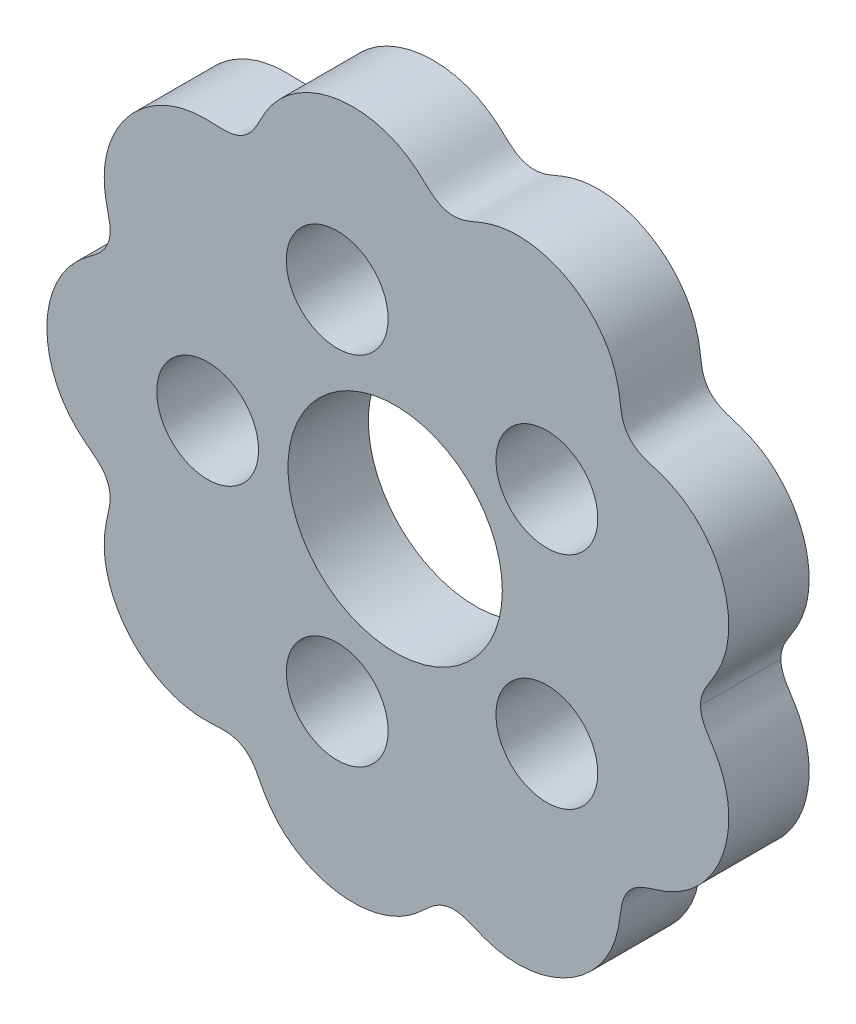
ISO-10303-21;
HEADER;
FILE_DESCRIPTION(('STEP AP214'),'2;1');
FILE_NAME('part.step','',(''),(''),'','','');
FILE_SCHEMA(('AUTOMOTIVE_DESIGN { 1 0 10303 214 1 1 1 1 }'));
ENDSEC;
DATA;
#1=APPLICATION_CONTEXT('core data for automotive mechanical design processes');
#2=APPLICATION_PROTOCOL_DEFINITION('international standard','automotive_design',2000,#1);
#3=PRODUCT_CONTEXT('',#1,'mechanical');
#4=PRODUCT('Part','Part','',(#3));
#5=PRODUCT_RELATED_PRODUCT_CATEGORY('part','',(#4));
#6=PRODUCT_DEFINITION_FORMATION('','',#4);
#7=PRODUCT_DEFINITION_CONTEXT('part definition',#1,'design');
#8=PRODUCT_DEFINITION('design','',#6,#7);
#9=PRODUCT_DEFINITION_SHAPE('','',#8);
#10=(LENGTH_UNIT() NAMED_UNIT(*) SI_UNIT(.MILLI.,.METRE.));
#11=(NAMED_UNIT(*) PLANE_ANGLE_UNIT() SI_UNIT($,.RADIAN.));
#12=(NAMED_UNIT(*) SI_UNIT($,.STERADIAN.) SOLID_ANGLE_UNIT());
#13=UNCERTAINTY_MEASURE_WITH_UNIT(LENGTH_MEASURE(1.E-05),#10,'distance_accuracy_value','');
#14=(GEOMETRIC_REPRESENTATION_CONTEXT(3) GLOBAL_UNCERTAINTY_ASSIGNED_CONTEXT((#13)) GLOBAL_UNIT_ASSIGNED_CONTEXT((#10,
#11,#12)) REPRESENTATION_CONTEXT('',''));
#15=CARTESIAN_POINT('',(0.,0.,0.));
#16=DIRECTION('',(0.,0.,1.));
#17=DIRECTION('',(1.,0.,0.));
#18=AXIS2_PLACEMENT_3D('',#15,#16,#17);
#19=CARTESIAN_POINT('',(11.3999989917467,1.81851572087898E-05,3.));
#20=CARTESIAN_POINT('',(11.3999990024026,0.000705439475057053,3.));
#21=CARTESIAN_POINT('',(11.4000420933702,0.0547863397009753,3.));
#22=CARTESIAN_POINT('',(11.4067352179657,0.162251476006239,3.));
#23=CARTESIAN_POINT('',(11.4363812233727,0.321248146223175,3.));
#24=CARTESIAN_POINT('',(11.5103206113927,0.522519574219464,3.));
#25=CARTESIAN_POINT('',(11.6102501358687,0.711732960326352,3.));
#26=CARTESIAN_POINT('',(11.7241130411315,0.892488779271416,3.));
#27=CARTESIAN_POINT('',(11.8693728476593,1.11645787558788,3.));
#28=CARTESIAN_POINT('',(12.0749889406882,1.46093017895599,3.));
#29=CARTESIAN_POINT('',(12.2930855405998,1.95204284639744,3.));
#30=CARTESIAN_POINT('',(12.4500317358036,2.60721321775751,3.));
#31=CARTESIAN_POINT('',(12.4748418562447,3.36093141714105,3.));
#32=CARTESIAN_POINT('',(12.3537522721841,4.10505088504915,3.));
#33=CARTESIAN_POINT('',(12.094334932653,4.81258084310001,3.));
#34=CARTESIAN_POINT('',(11.7059973573458,5.45860530180516,3.));
#35=CARTESIAN_POINT('',(11.1999239153354,6.01734901698739,3.));
#36=CARTESIAN_POINT('',(10.6570709906344,6.4157760932387,3.));
#37=CARTESIAN_POINT('',(10.1247002737361,6.67234800872518,3.));
#38=CARTESIAN_POINT('',(9.6417613060848,6.82893891993528,3.));
#39=CARTESIAN_POINT('',(9.2306062573709,6.94638484004782,3.));
#40=CARTESIAN_POINT('',(8.85286532051666,7.16043974210885,3.));
#41=CARTESIAN_POINT('',(8.57493041459187,7.49992463111007,3.));
#42=CARTESIAN_POINT('',(8.43897096337619,7.91194938965621,3.));
#43=CARTESIAN_POINT('',(8.39687968259317,8.33739873011806,3.));
#44=CARTESIAN_POINT('',(8.32300774126344,8.84028589815767,3.));
#45=CARTESIAN_POINT('',(8.15819324710137,9.40808556277449,3.));
#46=CARTESIAN_POINT('',(7.85493317619153,10.0098768493242,3.));
#47=CARTESIAN_POINT('',(7.38769966084967,10.6020235261066,3.));
#48=CARTESIAN_POINT('',(6.81358797818073,11.0935577658307,3.));
#49=CARTESIAN_POINT('',(6.15570462214443,11.4683226056225,3.));
#50=CARTESIAN_POINT('',(5.43672729516141,11.7116236986651,3.));
#51=CARTESIAN_POINT('',(4.77669842067262,11.7981492679716,3.));
#52=CARTESIAN_POINT('',(4.20773285261801,11.7749064101158,3.));
#53=CARTESIAN_POINT('',(3.73207554026398,11.6875130737394,3.));
#54=CARTESIAN_POINT('',(3.34884669272879,11.5727502965553,3.));
#55=CARTESIAN_POINT('',(2.97057002041107,11.4167919638044,3.));
#56=CARTESIAN_POINT('',(2.58506990398777,11.2479076487187,3.));
#57=CARTESIAN_POINT('',(2.16231493100206,11.1767501241042,3.));
#58=CARTESIAN_POINT('',(1.7361923809846,11.2621779174198,3.));
#59=CARTESIAN_POINT('',(1.37094004701185,11.4923489425404,3.));
#60=CARTESIAN_POINT('',(1.06602591445675,11.7912776366317,3.));
#61=CARTESIAN_POINT('',(0.688202454705581,12.1255865646436,3.));
#62=CARTESIAN_POINT('',(0.202850897512074,12.4496698770165,3.));
#63=CARTESIAN_POINT('',(-0.405523163007366,12.712162963489,3.));
#64=CARTESIAN_POINT('',(-1.12874115490884,12.8662185745688,3.));
#65=CARTESIAN_POINT('',(-2.06008778584659,12.8835964321083,3.));
#66=CARTESIAN_POINT('',(-2.97744493519412,12.6677352102254,3.));
#67=CARTESIAN_POINT('',(-3.81535367010169,12.2256055357117,3.));
#68=CARTESIAN_POINT('',(-4.44454049376201,11.6352304390279,3.));
#69=CARTESIAN_POINT('',(-4.79447486093211,11.1586623302305,3.));
#70=CARTESIAN_POINT('',(-5.0365286083116,10.7115176297563,3.));
#71=CARTESIAN_POINT('',(-5.22126998193903,10.326051933504,3.));
#72=CARTESIAN_POINT('',(-5.4873307792823,9.98555100308818,3.));
#73=CARTESIAN_POINT('',(-5.85982090683654,9.76113040464926,3.));
#74=CARTESIAN_POINT('',(-6.28185604719141,9.68537316295917,3.));
#75=CARTESIAN_POINT('',(-6.70171329511556,9.71265644556543,3.));
#76=CARTESIAN_POINT('',(-7.2052282592365,9.73347343135155,3.));
#77=CARTESIAN_POINT('',(-7.79367421932067,9.67927270455973,3.));
#78=CARTESIAN_POINT('',(-8.44483884445679,9.49441831131706,3.));
#79=CARTESIAN_POINT('',(-9.11955889728369,9.14265660631011,3.));
#80=CARTESIAN_POINT('',(-9.71117372586009,8.66704162205741,3.));
#81=CARTESIAN_POINT('',(-10.2003866631958,8.08920176324512,3.));
#82=CARTESIAN_POINT('',(-10.5706833952524,7.43037679956918,3.));
#83=CARTESIAN_POINT('',(-10.8061030666256,6.71388626148928,3.));
#84=CARTESIAN_POINT('',(-10.8841237114647,6.04461406055604,3.));
#85=CARTESIAN_POINT('',(-10.8438836577711,5.45482196469358,3.));
#86=CARTESIAN_POINT('',(-10.7406173019672,4.95723777198673,3.));
#87=CARTESIAN_POINT('',(-10.6350619348902,4.54296347080145,3.));
#88=CARTESIAN_POINT('',(-10.6237680921343,4.1091443268693,3.));
#89=CARTESIAN_POINT('',(-10.7709039530337,3.69581958921924,3.));
#90=CARTESIAN_POINT('',(-11.0539749845063,3.36672206141808,3.));
#91=CARTESIAN_POINT('',(-11.400668961427,3.11627514796072,3.));
#92=CARTESIAN_POINT('',(-11.7264206650194,2.86084047401432,3.));
#93=CARTESIAN_POINT('',(-12.0158354871817,2.58200229846591,3.));
#94=CARTESIAN_POINT('',(-12.2638944005597,2.28328683249548,3.));
#95=CARTESIAN_POINT('',(-12.4724801287949,1.97129926487625,3.));
#96=CARTESIAN_POINT('',(-12.6477521246535,1.63957867836261,3.));
#97=CARTESIAN_POINT('',(-12.7890789662336,1.29202143193634,3.));
#98=CARTESIAN_POINT('',(-12.8956000229937,0.932326970092357,3.));
#99=CARTESIAN_POINT('',(-12.9669245221612,0.56400149367318,3.));
#100=CARTESIAN_POINT('',(-12.9939386678957,0.283223765885403,3.));
#101=CARTESIAN_POINT('',(-12.99998179874,0.0951724036943985,3.));
#102=CARTESIAN_POINT('',(-13.0000002913471,0.00076278550905635,3.));
#103=CARTESIAN_POINT('',(-13.0000002439252,0.,3.));
#104=B_SPLINE_CURVE_WITH_KNOTS('',4,(#19,#20,#21,#22,#23,#24,#25,#26,#27,#28,#29,#30,#31,#32,
#33,#34,#35,#36,#37,#38,#39,#40,#41,#42,#43,#44,#45,#46,#47,#48,#49,#50,#51,#52,#53,#54,#55,#56,
#57,#58,#59,#60,#61,#62,#63,#64,#65,#66,#67,#68,#69,#70,#71,#72,#73,#74,#75,#76,#77,#78,#79,#80,
#81,#82,#83,#84,#85,#86,#87,#88,#89,#90,#91,#92,#93,#94,#95,#96,#97,#98,#99,#100,#101,#102,
#103),.UNSPECIFIED.,.F.,.F.,(5,1,1,1,1,1,1,1,1,1,1,1,1,1,1,1,1,1,1,1,1,1,1,1,1,1,1,1,1,1,1,1,1,
1,1,1,1,1,1,1,1,1,1,1,1,1,1,1,1,1,1,1,1,1,1,1,1,1,1,1,1,1,1,1,1,1,1,1,1,1,1,1,1,1,1,1,1,1,1,1,1,
5),(0.119653364188806,0.119702875056604,0.123549436924655,0.127395998792706,0.131242560660757,
0.135089122528808,0.138935684396859,0.142782246264911,0.150475370001013,0.163970387193504,
0.177465404385995,0.190960421578486,0.204455438770977,0.217945208915162,0.231434979059346,
0.24492474920353,0.258414519347714,0.266104685879341,0.273794852410968,0.281485018942595,
0.289175185474222,0.296870304377093,0.304565423279965,0.312260542182836,0.319955661085707,
0.333454153490124,0.346952645894541,0.360451138298958,0.373949630703374,0.387561798374503,
0.401173966045632,0.41478613371676,0.421592217552325,0.428398301387889,0.435960585437096,
0.443522869486303,0.451085153535511,0.458647437584718,0.466336371347433,0.474025305110148,
0.481714238872864,0.489403172635579,0.502638697892602,0.515874223149625,0.529109748406649,
0.542345273663672,0.569345726421422,0.582845952800297,0.596346179179172,0.604042304245698,
0.611738429312224,0.619434554378751,0.627130679445277,0.634693899127809,0.642257118810342,
0.649820338492875,0.657383558175408,0.670997536382291,0.684611514589174,0.698225492796057,
0.711839471002939,0.725336227369788,0.738832983736637,0.752329740103485,0.765826496470334,
0.773520615092133,0.781214733713933,0.788908852335733,0.796602970957532,0.804294119141854,
0.811985267326176,0.819676415510498,0.82736756369482,0.834113326269207,0.840859088843594,
0.847604851417981,0.854350613992368,0.861096376566755,0.867842139141142,0.874587901715529,
0.881333664289916,0.881388610828979),.UNSPECIFIED.);
#105=DIRECTION('',(0.,0.,-1.));
#106=VECTOR('',#105,1.);
#107=SURFACE_OF_LINEAR_EXTRUSION('',#104,#106);
#108=CARTESIAN_POINT('',(11.3999989917467,1.81851572087898E-05,0.));
#109=CARTESIAN_POINT('',(11.3999990024026,0.000705439475057053,0.));
#110=CARTESIAN_POINT('',(11.4000420933702,0.0547863397009753,0.));
#111=CARTESIAN_POINT('',(11.4067352179657,0.162251476006239,0.));
#112=CARTESIAN_POINT('',(11.4363812233727,0.321248146223175,0.));
#113=CARTESIAN_POINT('',(11.5103206113927,0.522519574219464,0.));
#114=CARTESIAN_POINT('',(11.6102501358687,0.711732960326352,0.));
#115=CARTESIAN_POINT('',(11.7241130411315,0.892488779271416,0.));
#116=CARTESIAN_POINT('',(11.8693728476593,1.11645787558788,0.));
#117=CARTESIAN_POINT('',(12.0749889406882,1.46093017895599,0.));
#118=CARTESIAN_POINT('',(12.2930855405998,1.95204284639744,0.));
#119=CARTESIAN_POINT('',(12.4500317358036,2.60721321775751,0.));
#120=CARTESIAN_POINT('',(12.4748418562447,3.36093141714105,0.));
#121=CARTESIAN_POINT('',(12.3537522721841,4.10505088504915,0.));
#122=CARTESIAN_POINT('',(12.094334932653,4.81258084310001,0.));
#123=CARTESIAN_POINT('',(11.7059973573458,5.45860530180516,0.));
#124=CARTESIAN_POINT('',(11.1999239153354,6.01734901698739,0.));
#125=CARTESIAN_POINT('',(10.6570709906344,6.4157760932387,0.));
#126=CARTESIAN_POINT('',(10.1247002737361,6.67234800872518,0.));
#127=CARTESIAN_POINT('',(9.6417613060848,6.82893891993528,0.));
#128=CARTESIAN_POINT('',(9.2306062573709,6.94638484004782,0.));
#129=CARTESIAN_POINT('',(8.85286532051666,7.16043974210885,0.));
#130=CARTESIAN_POINT('',(8.57493041459187,7.49992463111007,0.));
#131=CARTESIAN_POINT('',(8.43897096337619,7.91194938965621,0.));
#132=CARTESIAN_POINT('',(8.39687968259317,8.33739873011806,0.));
#133=CARTESIAN_POINT('',(8.32300774126344,8.84028589815767,0.));
#134=CARTESIAN_POINT('',(8.15819324710137,9.40808556277449,0.));
#135=CARTESIAN_POINT('',(7.85493317619153,10.0098768493242,0.));
#136=CARTESIAN_POINT('',(7.38769966084967,10.6020235261066,0.));
#137=CARTESIAN_POINT('',(6.81358797818073,11.0935577658307,0.));
#138=CARTESIAN_POINT('',(6.15570462214443,11.4683226056225,0.));
#139=CARTESIAN_POINT('',(5.43672729516141,11.7116236986651,0.));
#140=CARTESIAN_POINT('',(4.77669842067262,11.7981492679716,0.));
#141=CARTESIAN_POINT('',(4.20773285261801,11.7749064101158,0.));
#142=CARTESIAN_POINT('',(3.73207554026398,11.6875130737394,0.));
#143=CARTESIAN_POINT('',(3.34884669272879,11.5727502965553,0.));
#144=CARTESIAN_POINT('',(2.97057002041107,11.4167919638044,0.));
#145=CARTESIAN_POINT('',(2.58506990398777,11.2479076487187,0.));
#146=CARTESIAN_POINT('',(2.16231493100206,11.1767501241042,0.));
#147=CARTESIAN_POINT('',(1.7361923809846,11.2621779174198,0.));
#148=CARTESIAN_POINT('',(1.37094004701185,11.4923489425404,0.));
#149=CARTESIAN_POINT('',(1.06602591445675,11.7912776366317,0.));
#150=CARTESIAN_POINT('',(0.688202454705581,12.1255865646436,0.));
#151=CARTESIAN_POINT('',(0.202850897512074,12.4496698770165,0.));
#152=CARTESIAN_POINT('',(-0.405523163007366,12.712162963489,0.));
#153=CARTESIAN_POINT('',(-1.12874115490884,12.8662185745688,0.));
#154=CARTESIAN_POINT('',(-2.06008778584659,12.8835964321083,0.));
#155=CARTESIAN_POINT('',(-2.97744493519412,12.6677352102254,0.));
#156=CARTESIAN_POINT('',(-3.81535367010169,12.2256055357117,0.));
#157=CARTESIAN_POINT('',(-4.44454049376201,11.6352304390279,0.));
#158=CARTESIAN_POINT('',(-4.79447486093211,11.1586623302305,0.));
#159=CARTESIAN_POINT('',(-5.0365286083116,10.7115176297563,0.));
#160=CARTESIAN_POINT('',(-5.22126998193903,10.326051933504,0.));
#161=CARTESIAN_POINT('',(-5.4873307792823,9.98555100308818,0.));
#162=CARTESIAN_POINT('',(-5.85982090683654,9.76113040464926,0.));
#163=CARTESIAN_POINT('',(-6.28185604719141,9.68537316295917,0.));
#164=CARTESIAN_POINT('',(-6.70171329511556,9.71265644556543,0.));
#165=CARTESIAN_POINT('',(-7.2052282592365,9.73347343135155,0.));
#166=CARTESIAN_POINT('',(-7.79367421932067,9.67927270455973,0.));
#167=CARTESIAN_POINT('',(-8.44483884445679,9.49441831131706,0.));
#168=CARTESIAN_POINT('',(-9.11955889728369,9.14265660631011,0.));
#169=CARTESIAN_POINT('',(-9.71117372586009,8.66704162205741,0.));
#170=CARTESIAN_POINT('',(-10.2003866631958,8.08920176324512,0.));
#171=CARTESIAN_POINT('',(-10.5706833952524,7.43037679956918,0.));
#172=CARTESIAN_POINT('',(-10.8061030666256,6.71388626148928,0.));
#173=CARTESIAN_POINT('',(-10.8841237114647,6.04461406055604,0.));
#174=CARTESIAN_POINT('',(-10.8438836577711,5.45482196469358,0.));
#175=CARTESIAN_POINT('',(-10.7406173019672,4.95723777198673,0.));
#176=CARTESIAN_POINT('',(-10.6350619348902,4.54296347080145,0.));
#177=CARTESIAN_POINT('',(-10.6237680921343,4.1091443268693,0.));
#178=CARTESIAN_POINT('',(-10.7709039530337,3.69581958921924,0.));
#179=CARTESIAN_POINT('',(-11.0539749845063,3.36672206141808,0.));
#180=CARTESIAN_POINT('',(-11.400668961427,3.11627514796072,0.));
#181=CARTESIAN_POINT('',(-11.7264206650194,2.86084047401432,0.));
#182=CARTESIAN_POINT('',(-12.0158354871817,2.58200229846591,0.));
#183=CARTESIAN_POINT('',(-12.2638944005597,2.28328683249548,0.));
#184=CARTESIAN_POINT('',(-12.4724801287949,1.97129926487625,0.));
#185=CARTESIAN_POINT('',(-12.6477521246535,1.63957867836261,0.));
#186=CARTESIAN_POINT('',(-12.7890789662336,1.29202143193634,0.));
#187=CARTESIAN_POINT('',(-12.8956000229937,0.932326970092357,0.));
#188=CARTESIAN_POINT('',(-12.9669245221612,0.56400149367318,0.));
#189=CARTESIAN_POINT('',(-12.9939386678957,0.283223765885403,0.));
#190=CARTESIAN_POINT('',(-12.99998179874,0.0951724036943985,0.));
#191=CARTESIAN_POINT('',(-13.0000002913471,0.00076278550905635,0.));
#192=CARTESIAN_POINT('',(-13.0000002439252,0.,0.));
#193=B_SPLINE_CURVE_WITH_KNOTS('',4,(#108,#109,#110,#111,#112,#113,#114,#115,#116,#117,#118,
#119,#120,#121,#122,#123,#124,#125,#126,#127,#128,#129,#130,#131,#132,#133,#134,#135,#136,#137,
#138,#139,#140,#141,#142,#143,#144,#145,#146,#147,#148,#149,#150,#151,#152,#153,#154,#155,#156,
#157,#158,#159,#160,#161,#162,#163,#164,#165,#166,#167,#168,#169,#170,#171,#172,#173,#174,#175,
#176,#177,#178,#179,#180,#181,#182,#183,#184,#185,#186,#187,#188,#189,#190,#191,#192),
.UNSPECIFIED.,.F.,.F.,(5,1,1,1,1,1,1,1,1,1,1,1,1,1,1,1,1,1,1,1,1,1,1,1,1,1,1,1,1,1,1,1,1,1,1,1,
1,1,1,1,1,1,1,1,1,1,1,1,1,1,1,1,1,1,1,1,1,1,1,1,1,1,1,1,1,1,1,1,1,1,1,1,1,1,1,1,1,1,1,1,1,5),
(0.119653364188806,0.119702875056604,0.123549436924655,0.127395998792706,0.131242560660757,
0.135089122528808,0.138935684396859,0.142782246264911,0.150475370001013,0.163970387193504,
0.177465404385995,0.190960421578486,0.204455438770977,0.217945208915162,0.231434979059346,
0.24492474920353,0.258414519347714,0.266104685879341,0.273794852410968,0.281485018942595,
0.289175185474222,0.296870304377093,0.304565423279965,0.312260542182836,0.319955661085707,
0.333454153490124,0.346952645894541,0.360451138298958,0.373949630703374,0.387561798374503,
0.401173966045632,0.41478613371676,0.421592217552325,0.428398301387889,0.435960585437096,
0.443522869486303,0.451085153535511,0.458647437584718,0.466336371347433,0.474025305110148,
0.481714238872864,0.489403172635579,0.502638697892602,0.515874223149625,0.529109748406649,
0.542345273663672,0.569345726421422,0.582845952800297,0.596346179179172,0.604042304245698,
0.611738429312224,0.619434554378751,0.627130679445277,0.634693899127809,0.642257118810342,
0.649820338492875,0.657383558175408,0.670997536382291,0.684611514589174,0.698225492796057,
0.711839471002939,0.725336227369788,0.738832983736637,0.752329740103485,0.765826496470334,
0.773520615092133,0.781214733713933,0.788908852335733,0.796602970957532,0.804294119141854,
0.811985267326176,0.819676415510498,0.82736756369482,0.834113326269207,0.840859088843594,
0.847604851417981,0.854350613992368,0.861096376566755,0.867842139141142,0.874587901715529,
0.881333664289916,0.881388610828979),.UNSPECIFIED.);
#194=CARTESIAN_POINT('',(11.3999989915989,1.81851647786463E-05,0.));
#195=VERTEX_POINT('',#194);
#196=CARTESIAN_POINT('',(-13.0000002439252,-1.48388152961432E-11,0.));
#197=VERTEX_POINT('',#196);
#198=EDGE_CURVE('E73',#195,#197,#193,.T.);
#199=ORIENTED_EDGE('',*,*,#198,.T.);
#200=DIRECTION('',(0.,0.,-1.));
#201=VECTOR('',#200,1.);
#202=CARTESIAN_POINT('',(-13.0000002439252,-1.48388152961432E-11,3.));
#203=LINE('',#202,#201);
#204=CARTESIAN_POINT('',(-13.0000002439252,-1.48388152961432E-11,3.));
#205=VERTEX_POINT('',#204);
#206=EDGE_CURVE('E11',#205,#197,#203,.T.);
#207=ORIENTED_EDGE('',*,*,#206,.F.);
#208=CARTESIAN_POINT('',(11.3999989915989,1.81851647786463E-05,3.));
#209=VERTEX_POINT('',#208);
#210=EDGE_CURVE('E72',#209,#205,#104,.T.);
#211=ORIENTED_EDGE('',*,*,#210,.F.);
#212=DIRECTION('',(0.,0.,-1.));
#213=VECTOR('',#212,1.);
#214=CARTESIAN_POINT('',(11.3999989915989,1.81851647786463E-05,3.));
#215=LINE('',#214,#213);
#216=EDGE_CURVE('E49',#209,#195,#215,.T.);
#217=ORIENTED_EDGE('',*,*,#216,.T.);
#218=EDGE_LOOP('',(#199,#207,#211,#217));
#219=FACE_BOUND('',#218,.T.);
#220=ADVANCED_FACE('F39',(#219),#107,.F.);
#221=CARTESIAN_POINT('',(-13.0000002439252,-1.48388152961432E-11,3.));
#222=CARTESIAN_POINT('',(-13.0000002907787,-0.000762785523931889,3.));
#223=CARTESIAN_POINT('',(-12.9999817278085,-0.0951724036954654,3.));
#224=CARTESIAN_POINT('',(-12.9939384568106,-0.283223761382507,3.));
#225=CARTESIAN_POINT('',(-12.9669241018142,-0.564001469036718,3.));
#226=CARTESIAN_POINT('',(-12.8955993281358,-0.932326892298051,3.));
#227=CARTESIAN_POINT('',(-12.7890780032974,-1.2920212747524,3.));
#228=CARTESIAN_POINT('',(-12.647750902685,-1.63957841584849,3.));
#229=CARTESIAN_POINT('',(-12.472478659597,-1.97129887173282,3.));
#230=CARTESIAN_POINT('',(-12.2638926988393,-2.28328628389421,3.));
#231=CARTESIAN_POINT('',(-12.0158335628304,-2.58200156498768,3.));
#232=CARTESIAN_POINT('',(-11.7264185328517,-2.8608395248368,3.));
#233=CARTESIAN_POINT('',(-11.4006666388855,-3.11627395600224,3.));
#234=CARTESIAN_POINT('',(-11.0539724753082,-3.36672061107049,3.));
#235=CARTESIAN_POINT('',(-10.7709011985611,-3.69581792790034,3.));
#236=CARTESIAN_POINT('',(-10.6237650296132,-4.10914255589077,3.));
#237=CARTESIAN_POINT('',(-10.6350585490462,-4.54296170824003,3.));
#238=CARTESIAN_POINT('',(-10.7406136073669,-4.95723608809502,3.));
#239=CARTESIAN_POINT('',(-10.8438795923241,-5.45482035776555,3.));
#240=CARTESIAN_POINT('',(-10.8841192064491,-6.04461248361853,3.));
#241=CARTESIAN_POINT('',(-10.8060980628052,-6.71388462640325,3.));
#242=CARTESIAN_POINT('',(-10.5706778574357,-7.43037498902601,3.));
#243=CARTESIAN_POINT('',(-10.2003806343608,-8.08919967672173,3.));
#244=CARTESIAN_POINT('',(-9.71116726636451,-8.66703917092626,3.));
#245=CARTESIAN_POINT('',(-9.11955208331513,-9.14265371425168,3.));
#246=CARTESIAN_POINT('',(-8.44483176832244,-9.49441491639354,3.));
#247=CARTESIAN_POINT('',(-7.79366700541558,-9.67926882432689,3.));
#248=CARTESIAN_POINT('',(-7.20522100493608,-9.73346911255329,3.));
#249=CARTESIAN_POINT('',(-6.70170605633007,-9.71265175150036,3.));
#250=CARTESIAN_POINT('',(-6.2818488287401,-9.6853681559769,3.));
#251=CARTESIAN_POINT('',(-5.85981363192391,-9.76112508312659,3.));
#252=CARTESIAN_POINT('',(-5.48732333711038,-9.98554540395069,3.));
#253=CARTESIAN_POINT('',(-5.22126228599379,-10.3260461360729,3.));
#254=CARTESIAN_POINT('',(-5.03652062508104,-10.7115116946383,3.));
#255=CARTESIAN_POINT('',(-4.79446654444723,-11.1586562147111,3.));
#256=CARTESIAN_POINT('',(-4.44453182209374,-11.6352240627043,3.));
#257=CARTESIAN_POINT('',(-3.81534455843041,-12.2255986904586,3.));
#258=CARTESIAN_POINT('',(-2.97743549400635,-12.6677277404836,3.));
#259=CARTESIAN_POINT('',(-2.06007818377895,-12.8835882786655,3.));
#260=CARTESIAN_POINT('',(-1.12873156579308,-12.8662097269986,3.));
#261=CARTESIAN_POINT('',(-0.405513688708568,-12.7121535769086,3.));
#262=CARTESIAN_POINT('',(0.202860176176108,-12.4496600370184,3.));
#263=CARTESIAN_POINT('',(0.68821149183204,-12.1255763629159,3.));
#264=CARTESIAN_POINT('',(1.06603470242457,-11.7912671533145,3.));
#265=CARTESIAN_POINT('',(1.37094861218974,-11.4923382319725,3.));
#266=CARTESIAN_POINT('',(1.73620077461725,-11.2621669346315,3.));
#267=CARTESIAN_POINT('',(2.16232326096574,-11.1767388237292,3.));
#268=CARTESIAN_POINT('',(2.58507828698463,-11.2478960332668,3.));
#269=CARTESIAN_POINT('',(2.97057852927633,-11.4167800610414,3.));
#270=CARTESIAN_POINT('',(3.3488553178288,-11.5727381118648,3.));
#271=CARTESIAN_POINT('',(3.73208425089594,-11.6875006034307,3.));
#272=CARTESIAN_POINT('',(4.20774162838359,-11.7748935853023,3.));
#273=CARTESIAN_POINT('',(4.77670721376081,-11.7981360191114,3.));
#274=CARTESIAN_POINT('',(5.4367360237624,-11.7116099578892,3.));
#275=CARTESIAN_POINT('',(6.15571316941431,-11.4683083289969,3.));
#276=CARTESIAN_POINT('',(6.81359624614034,-11.0935429988885,3.));
#277=CARTESIAN_POINT('',(7.38770756247145,-10.6020083312824,3.));
#278=CARTESIAN_POINT('',(7.85494063648966,-10.0098613062737,3.));
#279=CARTESIAN_POINT('',(8.15820025888781,-9.4080697937062,3.));
#280=CARTESIAN_POINT('',(8.323014329872,-8.84027000625423,3.));
#281=CARTESIAN_POINT('',(8.39688589640278,-8.33738278315843,3.));
#282=CARTESIAN_POINT('',(8.43897686010083,-7.91193341132631,3.));
#283=CARTESIAN_POINT('',(8.57493600423678,-7.49990855145048,3.));
#284=CARTESIAN_POINT('',(8.85287065714535,-7.16042345530606,3.));
#285=CARTESIAN_POINT('',(9.23061143446559,-6.94636827171693,3.));
#286=CARTESIAN_POINT('',(9.6417663956476,-6.82892204517292,3.));
#287=CARTESIAN_POINT('',(10.1247052465924,-6.67233077403122,3.));
#288=CARTESIAN_POINT('',(10.657075772269,-6.41575846177195,3.));
#289=CARTESIAN_POINT('',(11.1999284000245,-6.01733098093558,3.));
#290=CARTESIAN_POINT('',(11.7060014256063,-5.45858688857986,3.));
#291=CARTESIAN_POINT('',(12.094338519435,-4.81256214044912,3.));
#292=CARTESIAN_POINT('',(12.353755331648,-4.1050319890562,3.));
#293=CARTESIAN_POINT('',(12.4748443611206,-3.36091243090093,3.));
#294=CARTESIAN_POINT('',(12.4500336789376,-2.60719425000845,3.));
#295=CARTESIAN_POINT('',(12.2930869954392,-1.95202399561965,3.));
#296=CARTESIAN_POINT('',(12.0749900295041,-1.46091149072449,3.));
#297=CARTESIAN_POINT('',(11.8693736797421,-1.11643934060097,3.));
#298=CARTESIAN_POINT('',(11.7241137062914,-0.892470352545872,3.));
#299=CARTESIAN_POINT('',(11.6102506663123,-0.71171461846223,3.));
#300=CARTESIAN_POINT('',(11.5103210008168,-0.522501306832296,3.));
#301=CARTESIAN_POINT('',(11.4363814627903,-0.321229933942666,3.));
#302=CARTESIAN_POINT('',(11.4067345010563,-0.162228792424007,3.));
#303=CARTESIAN_POINT('',(11.4000415679594,-0.0547590627214167,3.));
#304=CARTESIAN_POINT('',(11.3999989921146,-0.000673615444845709,3.));
#305=CARTESIAN_POINT('',(11.3999989915989,1.81851647786463E-05,3.));
#306=B_SPLINE_CURVE_WITH_KNOTS('',4,(#221,#222,#223,#224,#225,#226,#227,#228,#229,#230,#231,
#232,#233,#234,#235,#236,#237,#238,#239,#240,#241,#242,#243,#244,#245,#246,#247,#248,#249,#250,
#251,#252,#253,#254,#255,#256,#257,#258,#259,#260,#261,#262,#263,#264,#265,#266,#267,#268,#269,
#270,#271,#272,#273,#274,#275,#276,#277,#278,#279,#280,#281,#282,#283,#284,#285,#286,#287,#288,
#289,#290,#291,#292,#293,#294,#295,#296,#297,#298,#299,#300,#301,#302,#303,#304,#305),
.UNSPECIFIED.,.F.,.F.,(5,1,1,1,1,1,1,1,1,1,1,1,1,1,1,1,1,1,1,1,1,1,1,1,1,1,1,1,1,1,1,1,1,1,1,1,
1,1,1,1,1,1,1,1,1,1,1,1,1,1,1,1,1,1,1,1,1,1,1,1,1,1,1,1,1,1,1,1,1,1,1,1,1,1,1,1,1,1,1,1,1,5),
(0.119653036667072,0.119707983206134,0.126453745780521,0.133199508354908,0.139945270929295,
0.146691033503682,0.153436796078069,0.160182558652456,0.166928321226844,0.173674083801231,
0.181365231985553,0.189056380169875,0.196747528354197,0.204438676538519,0.212132795160318,
0.219826913782118,0.227521032403917,0.235215151025717,0.248711907392565,0.262208663759414,
0.275705420126263,0.289202176493111,0.302816154699994,0.316430132906877,0.33004411111376,
0.343658089320643,0.351221309003175,0.358784528685708,0.366347748368241,0.373910968050774,
0.3816070931173,0.389303218183827,0.396999343250353,0.404695468316879,0.418195694695754,
0.431695921074629,0.458696373832379,0.471931899089402,0.485167424346425,0.498402949603448,
0.511638474860472,0.519327408623187,0.527016342385902,0.534705276148618,0.542394209911333,
0.54995649396054,0.557518778009747,0.565081062058955,0.572643346108162,0.579449429943726,
0.58625551377929,0.599867681450419,0.613479849121548,0.627092016792676,0.640590509197093,
0.65408900160151,0.667587494005927,0.681085986410343,0.688781105313215,0.696476224216086,
0.704171343118957,0.711866462021828,0.719556628553455,0.727246795085082,0.734936961616709,
0.742627128148336,0.75611689829252,0.769606668436705,0.783096438580889,0.796586208725073,
0.810081225917564,0.823576243110056,0.837071260302547,0.850566277495038,0.85825940123114,
0.862105963099191,0.865952524967242,0.869799086835293,0.873645648703344,0.877492210571395,
0.881338772439446,0.881388610828979),.UNSPECIFIED.);
#307=DIRECTION('',(0.,0.,-1.));
#308=VECTOR('',#307,1.);
#309=SURFACE_OF_LINEAR_EXTRUSION('',#306,#308);
#310=CARTESIAN_POINT('',(-13.0000002439252,-1.48388152961432E-11,0.));
#311=CARTESIAN_POINT('',(-13.0000002907787,-0.000762785523931889,0.));
#312=CARTESIAN_POINT('',(-12.9999817278085,-0.0951724036954654,0.));
#313=CARTESIAN_POINT('',(-12.9939384568106,-0.283223761382507,0.));
#314=CARTESIAN_POINT('',(-12.9669241018142,-0.564001469036718,0.));
#315=CARTESIAN_POINT('',(-12.8955993281358,-0.932326892298051,0.));
#316=CARTESIAN_POINT('',(-12.7890780032974,-1.2920212747524,0.));
#317=CARTESIAN_POINT('',(-12.647750902685,-1.63957841584849,0.));
#318=CARTESIAN_POINT('',(-12.472478659597,-1.97129887173282,0.));
#319=CARTESIAN_POINT('',(-12.2638926988393,-2.28328628389421,0.));
#320=CARTESIAN_POINT('',(-12.0158335628304,-2.58200156498768,0.));
#321=CARTESIAN_POINT('',(-11.7264185328517,-2.8608395248368,0.));
#322=CARTESIAN_POINT('',(-11.4006666388855,-3.11627395600224,0.));
#323=CARTESIAN_POINT('',(-11.0539724753082,-3.36672061107049,0.));
#324=CARTESIAN_POINT('',(-10.7709011985611,-3.69581792790034,0.));
#325=CARTESIAN_POINT('',(-10.6237650296132,-4.10914255589077,0.));
#326=CARTESIAN_POINT('',(-10.6350585490462,-4.54296170824003,0.));
#327=CARTESIAN_POINT('',(-10.7406136073669,-4.95723608809502,0.));
#328=CARTESIAN_POINT('',(-10.8438795923241,-5.45482035776555,0.));
#329=CARTESIAN_POINT('',(-10.8841192064491,-6.04461248361853,0.));
#330=CARTESIAN_POINT('',(-10.8060980628052,-6.71388462640325,0.));
#331=CARTESIAN_POINT('',(-10.5706778574357,-7.43037498902601,0.));
#332=CARTESIAN_POINT('',(-10.2003806343608,-8.08919967672173,0.));
#333=CARTESIAN_POINT('',(-9.71116726636451,-8.66703917092626,0.));
#334=CARTESIAN_POINT('',(-9.11955208331513,-9.14265371425168,0.));
#335=CARTESIAN_POINT('',(-8.44483176832244,-9.49441491639354,0.));
#336=CARTESIAN_POINT('',(-7.79366700541558,-9.67926882432689,0.));
#337=CARTESIAN_POINT('',(-7.20522100493608,-9.73346911255329,0.));
#338=CARTESIAN_POINT('',(-6.70170605633007,-9.71265175150036,0.));
#339=CARTESIAN_POINT('',(-6.2818488287401,-9.6853681559769,0.));
#340=CARTESIAN_POINT('',(-5.85981363192391,-9.76112508312659,0.));
#341=CARTESIAN_POINT('',(-5.48732333711038,-9.98554540395069,0.));
#342=CARTESIAN_POINT('',(-5.22126228599379,-10.3260461360729,0.));
#343=CARTESIAN_POINT('',(-5.03652062508104,-10.7115116946383,0.));
#344=CARTESIAN_POINT('',(-4.79446654444723,-11.1586562147111,0.));
#345=CARTESIAN_POINT('',(-4.44453182209374,-11.6352240627043,0.));
#346=CARTESIAN_POINT('',(-3.81534455843041,-12.2255986904586,0.));
#347=CARTESIAN_POINT('',(-2.97743549400635,-12.6677277404836,0.));
#348=CARTESIAN_POINT('',(-2.06007818377895,-12.8835882786655,0.));
#349=CARTESIAN_POINT('',(-1.12873156579308,-12.8662097269986,0.));
#350=CARTESIAN_POINT('',(-0.405513688708568,-12.7121535769086,0.));
#351=CARTESIAN_POINT('',(0.202860176176108,-12.4496600370184,0.));
#352=CARTESIAN_POINT('',(0.68821149183204,-12.1255763629159,0.));
#353=CARTESIAN_POINT('',(1.06603470242457,-11.7912671533145,0.));
#354=CARTESIAN_POINT('',(1.37094861218974,-11.4923382319725,0.));
#355=CARTESIAN_POINT('',(1.73620077461725,-11.2621669346315,0.));
#356=CARTESIAN_POINT('',(2.16232326096574,-11.1767388237292,0.));
#357=CARTESIAN_POINT('',(2.58507828698463,-11.2478960332668,0.));
#358=CARTESIAN_POINT('',(2.97057852927633,-11.4167800610414,0.));
#359=CARTESIAN_POINT('',(3.3488553178288,-11.5727381118648,0.));
#360=CARTESIAN_POINT('',(3.73208425089594,-11.6875006034307,0.));
#361=CARTESIAN_POINT('',(4.20774162838359,-11.7748935853023,0.));
#362=CARTESIAN_POINT('',(4.77670721376081,-11.7981360191114,0.));
#363=CARTESIAN_POINT('',(5.4367360237624,-11.7116099578892,0.));
#364=CARTESIAN_POINT('',(6.15571316941431,-11.4683083289969,0.));
#365=CARTESIAN_POINT('',(6.81359624614034,-11.0935429988885,0.));
#366=CARTESIAN_POINT('',(7.38770756247145,-10.6020083312824,0.));
#367=CARTESIAN_POINT('',(7.85494063648966,-10.0098613062737,0.));
#368=CARTESIAN_POINT('',(8.15820025888781,-9.4080697937062,0.));
#369=CARTESIAN_POINT('',(8.323014329872,-8.84027000625423,0.));
#370=CARTESIAN_POINT('',(8.39688589640278,-8.33738278315843,0.));
#371=CARTESIAN_POINT('',(8.43897686010083,-7.91193341132631,0.));
#372=CARTESIAN_POINT('',(8.57493600423678,-7.49990855145048,0.));
#373=CARTESIAN_POINT('',(8.85287065714535,-7.16042345530606,0.));
#374=CARTESIAN_POINT('',(9.23061143446559,-6.94636827171693,0.));
#375=CARTESIAN_POINT('',(9.6417663956476,-6.82892204517292,0.));
#376=CARTESIAN_POINT('',(10.1247052465924,-6.67233077403122,0.));
#377=CARTESIAN_POINT('',(10.657075772269,-6.41575846177195,0.));
#378=CARTESIAN_POINT('',(11.1999284000245,-6.01733098093558,0.));
#379=CARTESIAN_POINT('',(11.7060014256063,-5.45858688857986,0.));
#380=CARTESIAN_POINT('',(12.094338519435,-4.81256214044912,0.));
#381=CARTESIAN_POINT('',(12.353755331648,-4.1050319890562,0.));
#382=CARTESIAN_POINT('',(12.4748443611206,-3.36091243090093,0.));
#383=CARTESIAN_POINT('',(12.4500336789376,-2.60719425000845,0.));
#384=CARTESIAN_POINT('',(12.2930869954392,-1.95202399561965,0.));
#385=CARTESIAN_POINT('',(12.0749900295041,-1.46091149072449,0.));
#386=CARTESIAN_POINT('',(11.8693736797421,-1.11643934060097,0.));
#387=CARTESIAN_POINT('',(11.7241137062914,-0.892470352545872,0.));
#388=CARTESIAN_POINT('',(11.6102506663123,-0.71171461846223,0.));
#389=CARTESIAN_POINT('',(11.5103210008168,-0.522501306832296,0.));
#390=CARTESIAN_POINT('',(11.4363814627903,-0.321229933942666,0.));
#391=CARTESIAN_POINT('',(11.4067345010563,-0.162228792424007,0.));
#392=CARTESIAN_POINT('',(11.4000415679594,-0.0547590627214167,0.));
#393=CARTESIAN_POINT('',(11.3999989921146,-0.000673615444845709,0.));
#394=CARTESIAN_POINT('',(11.3999989915989,1.81851647786463E-05,0.));
#395=B_SPLINE_CURVE_WITH_KNOTS('',4,(#310,#311,#312,#313,#314,#315,#316,#317,#318,#319,#320,
#321,#322,#323,#324,#325,#326,#327,#328,#329,#330,#331,#332,#333,#334,#335,#336,#337,#338,#339,
#340,#341,#342,#343,#344,#345,#346,#347,#348,#349,#350,#351,#352,#353,#354,#355,#356,#357,#358,
#359,#360,#361,#362,#363,#364,#365,#366,#367,#368,#369,#370,#371,#372,#373,#374,#375,#376,#377,
#378,#379,#380,#381,#382,#383,#384,#385,#386,#387,#388,#389,#390,#391,#392,#393,#394),
.UNSPECIFIED.,.F.,.F.,(5,1,1,1,1,1,1,1,1,1,1,1,1,1,1,1,1,1,1,1,1,1,1,1,1,1,1,1,1,1,1,1,1,1,1,1,
1,1,1,1,1,1,1,1,1,1,1,1,1,1,1,1,1,1,1,1,1,1,1,1,1,1,1,1,1,1,1,1,1,1,1,1,1,1,1,1,1,1,1,1,1,5),
(0.119653036667072,0.119707983206134,0.126453745780521,0.133199508354908,0.139945270929295,
0.146691033503682,0.153436796078069,0.160182558652456,0.166928321226844,0.173674083801231,
0.181365231985553,0.189056380169875,0.196747528354197,0.204438676538519,0.212132795160318,
0.219826913782118,0.227521032403917,0.235215151025717,0.248711907392565,0.262208663759414,
0.275705420126263,0.289202176493111,0.302816154699994,0.316430132906877,0.33004411111376,
0.343658089320643,0.351221309003175,0.358784528685708,0.366347748368241,0.373910968050774,
0.3816070931173,0.389303218183827,0.396999343250353,0.404695468316879,0.418195694695754,
0.431695921074629,0.458696373832379,0.471931899089402,0.485167424346425,0.498402949603448,
0.511638474860472,0.519327408623187,0.527016342385902,0.534705276148618,0.542394209911333,
0.54995649396054,0.557518778009747,0.565081062058955,0.572643346108162,0.579449429943726,
0.58625551377929,0.599867681450419,0.613479849121548,0.627092016792676,0.640590509197093,
0.65408900160151,0.667587494005927,0.681085986410343,0.688781105313215,0.696476224216086,
0.704171343118957,0.711866462021828,0.719556628553455,0.727246795085082,0.734936961616709,
0.742627128148336,0.75611689829252,0.769606668436705,0.783096438580889,0.796586208725073,
0.810081225917564,0.823576243110056,0.837071260302547,0.850566277495038,0.85825940123114,
0.862105963099191,0.865952524967242,0.869799086835293,0.873645648703344,0.877492210571395,
0.881338772439446,0.881388610828979),.UNSPECIFIED.);
#396=EDGE_CURVE('E64',#197,#195,#395,.T.);
#397=ORIENTED_EDGE('',*,*,#396,.T.);
#398=ORIENTED_EDGE('',*,*,#216,.F.);
#399=EDGE_CURVE('E56',#205,#209,#306,.T.);
#400=ORIENTED_EDGE('',*,*,#399,.F.);
#401=ORIENTED_EDGE('',*,*,#206,.T.);
#402=EDGE_LOOP('',(#397,#398,#400,#401));
#403=FACE_BOUND('',#402,.T.);
#404=ADVANCED_FACE('F67',(#403),#309,.F.);
#405=CARTESIAN_POINT('',(0.0363436857115426,12.5055233558696,3.));
#406=DIRECTION('',(0.,0.,1.));
#407=DIRECTION('',(1.,0.,0.));
#408=AXIS2_PLACEMENT_3D('',#405,#406,#407);
#409=PLANE('',#408);
#410=CARTESIAN_POINT('',(-7.,0.,3.));
#411=DIRECTION('',(0.,0.,1.));
#412=DIRECTION('',(1.,0.,0.));
#413=AXIS2_PLACEMENT_3D('',#410,#411,#412);
#414=CIRCLE('',#413,1.9);
#415=CARTESIAN_POINT('',(-5.1,0.,3.));
#416=VERTEX_POINT('',#415);
#417=EDGE_CURVE('E206',#416,#416,#414,.T.);
#418=ORIENTED_EDGE('',*,*,#417,.F.);
#419=EDGE_LOOP('',(#418));
#420=FACE_BOUND('',#419,.T.);
#421=CARTESIAN_POINT('',(-2.16311896062461,6.65739561406608,3.));
#422=DIRECTION('',(0.,0.,1.));
#423=DIRECTION('',(1.,0.,0.));
#424=AXIS2_PLACEMENT_3D('',#421,#422,#423);
#425=CIRCLE('',#424,1.9);
#426=CARTESIAN_POINT('',(-0.263118960624614,6.65739561406608,3.));
#427=VERTEX_POINT('',#426);
#428=EDGE_CURVE('E214',#427,#427,#425,.T.);
#429=ORIENTED_EDGE('',*,*,#428,.F.);
#430=EDGE_LOOP('',(#429));
#431=FACE_BOUND('',#430,.T.);
#432=CARTESIAN_POINT('',(5.66311896062466,4.11449676604728,3.));
#433=DIRECTION('',(0.,0.,1.));
#434=DIRECTION('',(1.,0.,0.));
#435=AXIS2_PLACEMENT_3D('',#432,#433,#434);
#436=CIRCLE('',#435,1.9);
#437=CARTESIAN_POINT('',(7.56311896062466,4.11449676604728,3.));
#438=VERTEX_POINT('',#437);
#439=EDGE_CURVE('E224',#438,#438,#436,.T.);
#440=ORIENTED_EDGE('',*,*,#439,.F.);
#441=EDGE_LOOP('',(#440));
#442=FACE_BOUND('',#441,.T.);
#443=CARTESIAN_POINT('',(5.6631189606246,-4.11449676604736,3.));
#444=DIRECTION('',(0.,0.,1.));
#445=DIRECTION('',(1.,0.,0.));
#446=AXIS2_PLACEMENT_3D('',#443,#444,#445);
#447=CIRCLE('',#446,1.9);
#448=CARTESIAN_POINT('',(7.5631189606246,-4.11449676604736,3.));
#449=VERTEX_POINT('',#448);
#450=EDGE_CURVE('E232',#449,#449,#447,.T.);
#451=ORIENTED_EDGE('',*,*,#450,.F.);
#452=EDGE_LOOP('',(#451));
#453=FACE_BOUND('',#452,.T.);
#454=CARTESIAN_POINT('',(-2.16311896062471,-6.65739561406605,3.));
#455=DIRECTION('',(0.,0.,1.));
#456=DIRECTION('',(1.,0.,0.));
#457=AXIS2_PLACEMENT_3D('',#454,#455,#456);
#458=CIRCLE('',#457,1.9);
#459=CARTESIAN_POINT('',(-0.263118960624706,-6.65739561406605,3.));
#460=VERTEX_POINT('',#459);
#461=EDGE_CURVE('E240',#460,#460,#458,.T.);
#462=ORIENTED_EDGE('',*,*,#461,.F.);
#463=EDGE_LOOP('',(#462));
#464=FACE_BOUND('',#463,.T.);
#465=CARTESIAN_POINT('',(0.,0.,3.));
#466=DIRECTION('',(0.,0.,1.));
#467=DIRECTION('',(1.,0.,0.));
#468=AXIS2_PLACEMENT_3D('',#465,#466,#467);
#469=CIRCLE('',#468,4.);
#470=CARTESIAN_POINT('',(4.,0.,3.));
#471=VERTEX_POINT('',#470);
#472=EDGE_CURVE('E83',#471,#471,#469,.T.);
#473=ORIENTED_EDGE('',*,*,#472,.F.);
#474=EDGE_LOOP('',(#473));
#475=FACE_BOUND('',#474,.T.);
#476=ORIENTED_EDGE('',*,*,#210,.T.);
#477=ORIENTED_EDGE('',*,*,#399,.T.);
#478=EDGE_LOOP('',(#476,#477));
#479=FACE_BOUND('',#478,.T.);
#480=ADVANCED_FACE('F109',(#420,#431,#442,#453,#464,#475,#479),#409,.T.);
#481=CARTESIAN_POINT('',(0.0363436857115426,12.5055233558696,0.));
#482=DIRECTION('',(0.,0.,1.));
#483=DIRECTION('',(1.,0.,0.));
#484=AXIS2_PLACEMENT_3D('',#481,#482,#483);
#485=PLANE('',#484);
#486=CARTESIAN_POINT('',(-7.,0.,0.));
#487=DIRECTION('',(0.,0.,1.));
#488=DIRECTION('',(1.,0.,0.));
#489=AXIS2_PLACEMENT_3D('',#486,#487,#488);
#490=CIRCLE('',#489,1.9);
#491=CARTESIAN_POINT('',(-5.1,0.,0.));
#492=VERTEX_POINT('',#491);
#493=EDGE_CURVE('E203',#492,#492,#490,.T.);
#494=ORIENTED_EDGE('',*,*,#493,.T.);
#495=EDGE_LOOP('',(#494));
#496=FACE_BOUND('',#495,.T.);
#497=CARTESIAN_POINT('',(-2.16311896062461,6.65739561406608,0.));
#498=DIRECTION('',(0.,0.,1.));
#499=DIRECTION('',(1.,0.,0.));
#500=AXIS2_PLACEMENT_3D('',#497,#498,#499);
#501=CIRCLE('',#500,1.9);
#502=CARTESIAN_POINT('',(-0.263118960624614,6.65739561406608,0.));
#503=VERTEX_POINT('',#502);
#504=EDGE_CURVE('E208',#503,#503,#501,.T.);
#505=ORIENTED_EDGE('',*,*,#504,.T.);
#506=EDGE_LOOP('',(#505));
#507=FACE_BOUND('',#506,.T.);
#508=CARTESIAN_POINT('',(5.66311896062466,4.11449676604728,0.));
#509=DIRECTION('',(0.,0.,1.));
#510=DIRECTION('',(1.,0.,0.));
#511=AXIS2_PLACEMENT_3D('',#508,#509,#510);
#512=CIRCLE('',#511,1.9);
#513=CARTESIAN_POINT('',(7.56311896062466,4.11449676604728,0.));
#514=VERTEX_POINT('',#513);
#515=EDGE_CURVE('E220',#514,#514,#512,.T.);
#516=ORIENTED_EDGE('',*,*,#515,.T.);
#517=EDGE_LOOP('',(#516));
#518=FACE_BOUND('',#517,.T.);
#519=CARTESIAN_POINT('',(5.6631189606246,-4.11449676604736,0.));
#520=DIRECTION('',(0.,0.,1.));
#521=DIRECTION('',(1.,0.,0.));
#522=AXIS2_PLACEMENT_3D('',#519,#520,#521);
#523=CIRCLE('',#522,1.9);
#524=CARTESIAN_POINT('',(7.5631189606246,-4.11449676604736,0.));
#525=VERTEX_POINT('',#524);
#526=EDGE_CURVE('E228',#525,#525,#523,.T.);
#527=ORIENTED_EDGE('',*,*,#526,.T.);
#528=EDGE_LOOP('',(#527));
#529=FACE_BOUND('',#528,.T.);
#530=CARTESIAN_POINT('',(-2.16311896062471,-6.65739561406605,0.));
#531=DIRECTION('',(0.,0.,1.));
#532=DIRECTION('',(1.,0.,0.));
#533=AXIS2_PLACEMENT_3D('',#530,#531,#532);
#534=CIRCLE('',#533,1.9);
#535=CARTESIAN_POINT('',(-0.263118960624706,-6.65739561406605,0.));
#536=VERTEX_POINT('',#535);
#537=EDGE_CURVE('E236',#536,#536,#534,.T.);
#538=ORIENTED_EDGE('',*,*,#537,.T.);
#539=EDGE_LOOP('',(#538));
#540=FACE_BOUND('',#539,.T.);
#541=CARTESIAN_POINT('',(0.,0.,0.));
#542=DIRECTION('',(0.,0.,1.));
#543=DIRECTION('',(1.,0.,0.));
#544=AXIS2_PLACEMENT_3D('',#541,#542,#543);
#545=CIRCLE('',#544,4.);
#546=CARTESIAN_POINT('',(4.,0.,0.));
#547=VERTEX_POINT('',#546);
#548=EDGE_CURVE('E79',#547,#547,#545,.T.);
#549=ORIENTED_EDGE('',*,*,#548,.T.);
#550=EDGE_LOOP('',(#549));
#551=FACE_BOUND('',#550,.T.);
#552=ORIENTED_EDGE('',*,*,#198,.F.);
#553=ORIENTED_EDGE('',*,*,#396,.F.);
#554=EDGE_LOOP('',(#552,#553));
#555=FACE_BOUND('',#554,.T.);
#556=ADVANCED_FACE('F77',(#496,#507,#518,#529,#540,#551,#555),#485,.F.);
#557=CARTESIAN_POINT('',(0.,0.,0.));
#558=DIRECTION('',(0.,0.,1.));
#559=DIRECTION('',(1.,0.,0.));
#560=AXIS2_PLACEMENT_3D('',#557,#558,#559);
#561=CYLINDRICAL_SURFACE('',#560,4.);
#562=ORIENTED_EDGE('',*,*,#548,.F.);
#563=EDGE_LOOP('',(#562));
#564=FACE_BOUND('',#563,.T.);
#565=ORIENTED_EDGE('',*,*,#472,.T.);
#566=EDGE_LOOP('',(#565));
#567=FACE_BOUND('',#566,.T.);
#568=ADVANCED_FACE('F112',(#564,#567),#561,.F.);
#569=CARTESIAN_POINT('',(-2.16311896062471,-6.65739561406605,0.));
#570=DIRECTION('',(0.,0.,1.));
#571=DIRECTION('',(1.,0.,0.));
#572=AXIS2_PLACEMENT_3D('',#569,#570,#571);
#573=CYLINDRICAL_SURFACE('',#572,1.9);
#574=ORIENTED_EDGE('',*,*,#537,.F.);
#575=EDGE_LOOP('',(#574));
#576=FACE_BOUND('',#575,.T.);
#577=ORIENTED_EDGE('',*,*,#461,.T.);
#578=EDGE_LOOP('',(#577));
#579=FACE_BOUND('',#578,.T.);
#580=ADVANCED_FACE('F119',(#576,#579),#573,.F.);
#581=CARTESIAN_POINT('',(5.6631189606246,-4.11449676604736,0.));
#582=DIRECTION('',(0.,0.,1.));
#583=DIRECTION('',(1.,0.,0.));
#584=AXIS2_PLACEMENT_3D('',#581,#582,#583);
#585=CYLINDRICAL_SURFACE('',#584,1.9);
#586=ORIENTED_EDGE('',*,*,#526,.F.);
#587=EDGE_LOOP('',(#586));
#588=FACE_BOUND('',#587,.T.);
#589=ORIENTED_EDGE('',*,*,#450,.T.);
#590=EDGE_LOOP('',(#589));
#591=FACE_BOUND('',#590,.T.);
#592=ADVANCED_FACE('F123',(#588,#591),#585,.F.);
#593=CARTESIAN_POINT('',(5.66311896062466,4.11449676604728,0.));
#594=DIRECTION('',(0.,0.,1.));
#595=DIRECTION('',(1.,0.,0.));
#596=AXIS2_PLACEMENT_3D('',#593,#594,#595);
#597=CYLINDRICAL_SURFACE('',#596,1.9);
#598=ORIENTED_EDGE('',*,*,#515,.F.);
#599=EDGE_LOOP('',(#598));
#600=FACE_BOUND('',#599,.T.);
#601=ORIENTED_EDGE('',*,*,#439,.T.);
#602=EDGE_LOOP('',(#601));
#603=FACE_BOUND('',#602,.T.);
#604=ADVANCED_FACE('F127',(#600,#603),#597,.F.);
#605=CARTESIAN_POINT('',(-2.16311896062461,6.65739561406608,0.));
#606=DIRECTION('',(0.,0.,1.));
#607=DIRECTION('',(1.,0.,0.));
#608=AXIS2_PLACEMENT_3D('',#605,#606,#607);
#609=CYLINDRICAL_SURFACE('',#608,1.9);
#610=ORIENTED_EDGE('',*,*,#504,.F.);
#611=EDGE_LOOP('',(#610));
#612=FACE_BOUND('',#611,.T.);
#613=ORIENTED_EDGE('',*,*,#428,.T.);
#614=EDGE_LOOP('',(#613));
#615=FACE_BOUND('',#614,.T.);
#616=ADVANCED_FACE('F131',(#612,#615),#609,.F.);
#617=CARTESIAN_POINT('',(-7.,0.,0.));
#618=DIRECTION('',(0.,0.,1.));
#619=DIRECTION('',(1.,0.,0.));
#620=AXIS2_PLACEMENT_3D('',#617,#618,#619);
#621=CYLINDRICAL_SURFACE('',#620,1.9);
#622=ORIENTED_EDGE('',*,*,#493,.F.);
#623=EDGE_LOOP('',(#622));
#624=FACE_BOUND('',#623,.T.);
#625=ORIENTED_EDGE('',*,*,#417,.T.);
#626=EDGE_LOOP('',(#625));
#627=FACE_BOUND('',#626,.T.);
#628=ADVANCED_FACE('F135',(#624,#627),#621,.F.);
#629=CLOSED_SHELL('',(#220,#404,#480,#556,#568,#580,#592,#604,#616,#628));
#630=MANIFOLD_SOLID_BREP('B2',#629);
#631=ADVANCED_BREP_SHAPE_REPRESENTATION('',(#18,#630),#14);
#632=SHAPE_DEFINITION_REPRESENTATION(#9,#631);
ENDSEC;
END-ISO-10303-21;
